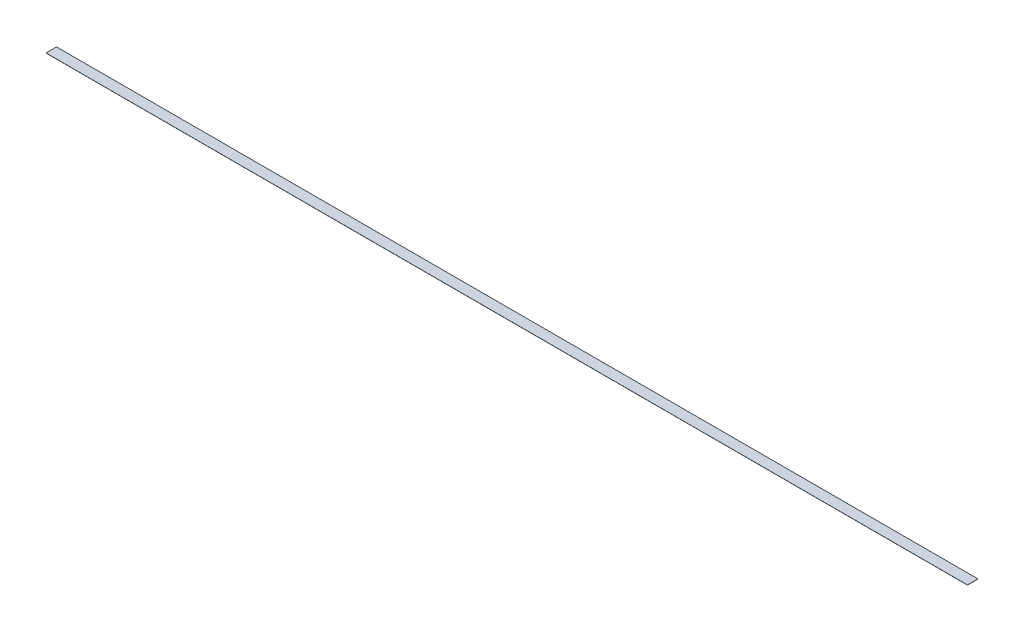
ISO-10303-21;
HEADER;
FILE_DESCRIPTION(('STEP AP214'),'2;1');
FILE_NAME('part.step','',(''),(''),'','','');
FILE_SCHEMA(('AUTOMOTIVE_DESIGN { 1 0 10303 214 1 1 1 1 }'));
ENDSEC;
DATA;
#1=APPLICATION_CONTEXT('core data for automotive mechanical design processes');
#2=APPLICATION_PROTOCOL_DEFINITION('international standard','automotive_design',2000,#1);
#3=PRODUCT_CONTEXT('',#1,'mechanical');
#4=PRODUCT('Part','Part','',(#3));
#5=PRODUCT_RELATED_PRODUCT_CATEGORY('part','',(#4));
#6=PRODUCT_DEFINITION_FORMATION('','',#4);
#7=PRODUCT_DEFINITION_CONTEXT('part definition',#1,'design');
#8=PRODUCT_DEFINITION('design','',#6,#7);
#9=PRODUCT_DEFINITION_SHAPE('','',#8);
#10=(LENGTH_UNIT() NAMED_UNIT(*) SI_UNIT(.MILLI.,.METRE.));
#11=(NAMED_UNIT(*) PLANE_ANGLE_UNIT() SI_UNIT($,.RADIAN.));
#12=(NAMED_UNIT(*) SI_UNIT($,.STERADIAN.) SOLID_ANGLE_UNIT());
#13=UNCERTAINTY_MEASURE_WITH_UNIT(LENGTH_MEASURE(1.E-05),#10,'distance_accuracy_value','');
#14=(GEOMETRIC_REPRESENTATION_CONTEXT(3) GLOBAL_UNCERTAINTY_ASSIGNED_CONTEXT((#13)) GLOBAL_UNIT_ASSIGNED_CONTEXT((#10,
#11,#12)) REPRESENTATION_CONTEXT('',''));
#15=CARTESIAN_POINT('',(0.,0.,0.));
#16=DIRECTION('',(0.,0.,1.));
#17=DIRECTION('',(1.,0.,0.));
#18=AXIS2_PLACEMENT_3D('',#15,#16,#17);
#19=CARTESIAN_POINT('',(2.22044604925031E-13,-0.249999999999905,-1.66533453693773E-13));
#20=DIRECTION('',(0.,-1.,0.));
#21=DIRECTION('',(0.,0.,-1.));
#22=AXIS2_PLACEMENT_3D('',#19,#20,#21);
#23=PLANE('',#22);
#24=DIRECTION('',(1.,0.,0.));
#25=VECTOR('',#24,1.);
#26=CARTESIAN_POINT('',(-1842.,-0.249999999999925,-2.22044604925031E-13));
#27=LINE('',#26,#25);
#28=CARTESIAN_POINT('',(-1842.,-0.250000000000036,-5.55111512312578E-13));
#29=VERTEX_POINT('',#28);
#30=CARTESIAN_POINT('',(0.,-0.25,0.));
#31=VERTEX_POINT('',#30);
#32=EDGE_CURVE('E129',#29,#31,#27,.T.);
#33=ORIENTED_EDGE('',*,*,#32,.F.);
#34=DIRECTION('',(0.,0.,1.));
#35=VECTOR('',#34,1.);
#36=CARTESIAN_POINT('',(-1842.,-0.250000000000036,-5.55111512312578E-13));
#37=LINE('',#36,#35);
#38=CARTESIAN_POINT('',(-1842.,-0.249999999999876,-21.0000000000005));
#39=VERTEX_POINT('',#38);
#40=EDGE_CURVE('E173',#39,#29,#37,.T.);
#41=ORIENTED_EDGE('',*,*,#40,.F.);
#42=DIRECTION('',(-1.,0.,0.));
#43=VECTOR('',#42,1.);
#44=CARTESIAN_POINT('',(-1842.,-0.249999999999876,-21.0000000000002));
#45=LINE('',#44,#43);
#46=CARTESIAN_POINT('',(0.,-0.25,-21.));
#47=VERTEX_POINT('',#46);
#48=EDGE_CURVE('E12',#47,#39,#45,.T.);
#49=ORIENTED_EDGE('',*,*,#48,.F.);
#50=DIRECTION('',(0.,0.,-1.));
#51=VECTOR('',#50,1.);
#52=CARTESIAN_POINT('',(0.,-0.25,0.));
#53=LINE('',#52,#51);
#54=EDGE_CURVE('E169',#31,#47,#53,.T.);
#55=ORIENTED_EDGE('',*,*,#54,.F.);
#56=EDGE_LOOP('',(#33,#41,#49,#55));
#57=FACE_BOUND('',#56,.T.);
#58=ADVANCED_FACE('F109',(#57),#23,.T.);
#59=CARTESIAN_POINT('',(-1842.,-0.249999999999925,-2.22044604925031E-13));
#60=DIRECTION('',(0.,0.,1.));
#61=DIRECTION('',(1.,0.,0.));
#62=AXIS2_PLACEMENT_3D('',#59,#60,#61);
#63=PLANE('',#62);
#64=DIRECTION('',(1.,0.,0.));
#65=VECTOR('',#64,1.);
#66=CARTESIAN_POINT('',(-1842.,0.,-2.22044604925031E-13));
#67=LINE('',#66,#65);
#68=CARTESIAN_POINT('',(-1842.,0.,-4.9960036108132E-13));
#69=VERTEX_POINT('',#68);
#70=CARTESIAN_POINT('',(0.,0.,0.));
#71=VERTEX_POINT('',#70);
#72=EDGE_CURVE('E147',#69,#71,#67,.T.);
#73=ORIENTED_EDGE('',*,*,#72,.F.);
#74=DIRECTION('',(0.,1.,0.));
#75=VECTOR('',#74,1.);
#76=CARTESIAN_POINT('',(-1842.,-0.250000000000036,-5.55111512312578E-13));
#77=LINE('',#76,#75);
#78=EDGE_CURVE('E180',#29,#69,#77,.T.);
#79=ORIENTED_EDGE('',*,*,#78,.F.);
#80=ORIENTED_EDGE('',*,*,#32,.T.);
#81=DIRECTION('',(0.,1.,0.));
#82=VECTOR('',#81,1.);
#83=CARTESIAN_POINT('',(0.,-0.25,0.));
#84=LINE('',#83,#82);
#85=EDGE_CURVE('E171',#31,#71,#84,.T.);
#86=ORIENTED_EDGE('',*,*,#85,.T.);
#87=EDGE_LOOP('',(#73,#79,#80,#86));
#88=FACE_BOUND('',#87,.T.);
#89=ADVANCED_FACE('F196',(#88),#63,.T.);
#90=CARTESIAN_POINT('',(-1842.,-0.249999999999876,-21.0000000000002));
#91=DIRECTION('',(0.,0.,-1.));
#92=DIRECTION('',(-1.,0.,0.));
#93=AXIS2_PLACEMENT_3D('',#90,#91,#92);
#94=PLANE('',#93);
#95=ORIENTED_EDGE('',*,*,#48,.T.);
#96=DIRECTION('',(0.,1.,0.));
#97=VECTOR('',#96,1.);
#98=CARTESIAN_POINT('',(-1842.,-0.249999999999876,-21.0000000000005));
#99=LINE('',#98,#97);
#100=CARTESIAN_POINT('',(-1842.,0.,-21.0000000000005));
#101=VERTEX_POINT('',#100);
#102=EDGE_CURVE('E159',#39,#101,#99,.T.);
#103=ORIENTED_EDGE('',*,*,#102,.T.);
#104=DIRECTION('',(-1.,0.,0.));
#105=VECTOR('',#104,1.);
#106=CARTESIAN_POINT('',(-1842.,0.,-21.0000000000002));
#107=LINE('',#106,#105);
#108=CARTESIAN_POINT('',(0.,0.,-21.));
#109=VERTEX_POINT('',#108);
#110=EDGE_CURVE('E120',#109,#101,#107,.T.);
#111=ORIENTED_EDGE('',*,*,#110,.F.);
#112=DIRECTION('',(0.,1.,0.));
#113=VECTOR('',#112,1.);
#114=CARTESIAN_POINT('',(0.,-0.25,-21.));
#115=LINE('',#114,#113);
#116=EDGE_CURVE('E157',#47,#109,#115,.T.);
#117=ORIENTED_EDGE('',*,*,#116,.F.);
#118=EDGE_LOOP('',(#95,#103,#111,#117));
#119=FACE_BOUND('',#118,.T.);
#120=ADVANCED_FACE('F156',(#119),#94,.T.);
#121=CARTESIAN_POINT('',(0.,0.,0.));
#122=DIRECTION('',(0.,-1.,0.));
#123=DIRECTION('',(0.,0.,-1.));
#124=AXIS2_PLACEMENT_3D('',#121,#122,#123);
#125=PLANE('',#124);
#126=ORIENTED_EDGE('',*,*,#110,.T.);
#127=DIRECTION('',(0.,0.,1.));
#128=VECTOR('',#127,1.);
#129=CARTESIAN_POINT('',(-1842.,0.,-4.9960036108132E-13));
#130=LINE('',#129,#128);
#131=EDGE_CURVE('E177',#101,#69,#130,.T.);
#132=ORIENTED_EDGE('',*,*,#131,.T.);
#133=ORIENTED_EDGE('',*,*,#72,.T.);
#134=DIRECTION('',(0.,0.,-1.));
#135=VECTOR('',#134,1.);
#136=CARTESIAN_POINT('',(0.,0.,0.));
#137=LINE('',#136,#135);
#138=EDGE_CURVE('E168',#71,#109,#137,.T.);
#139=ORIENTED_EDGE('',*,*,#138,.T.);
#140=EDGE_LOOP('',(#126,#132,#133,#139));
#141=FACE_BOUND('',#140,.T.);
#142=ADVANCED_FACE('F111',(#141),#125,.F.);
#143=CARTESIAN_POINT('',(-1842.,-0.250000000000036,-5.55111512312578E-13));
#144=DIRECTION('',(-1.,0.,0.));
#145=DIRECTION('',(0.,0.,1.));
#146=AXIS2_PLACEMENT_3D('',#143,#144,#145);
#147=PLANE('',#146);
#148=ORIENTED_EDGE('',*,*,#131,.F.);
#149=ORIENTED_EDGE('',*,*,#102,.F.);
#150=ORIENTED_EDGE('',*,*,#40,.T.);
#151=ORIENTED_EDGE('',*,*,#78,.T.);
#152=EDGE_LOOP('',(#148,#149,#150,#151));
#153=FACE_BOUND('',#152,.T.);
#154=ADVANCED_FACE('F194',(#153),#147,.T.);
#155=CARTESIAN_POINT('',(0.,-0.25,0.));
#156=DIRECTION('',(1.,0.,0.));
#157=DIRECTION('',(0.,0.,-1.));
#158=AXIS2_PLACEMENT_3D('',#155,#156,#157);
#159=PLANE('',#158);
#160=ORIENTED_EDGE('',*,*,#138,.F.);
#161=ORIENTED_EDGE('',*,*,#85,.F.);
#162=ORIENTED_EDGE('',*,*,#54,.T.);
#163=ORIENTED_EDGE('',*,*,#116,.T.);
#164=EDGE_LOOP('',(#160,#161,#162,#163));
#165=FACE_BOUND('',#164,.T.);
#166=ADVANCED_FACE('F167',(#165),#159,.T.);
#167=CLOSED_SHELL('',(#58,#89,#120,#142,#154,#166));
#168=MANIFOLD_SOLID_BREP('B2',#167);
#169=ADVANCED_BREP_SHAPE_REPRESENTATION('',(#18,#168),#14);
#170=SHAPE_DEFINITION_REPRESENTATION(#9,#169);
ENDSEC;
END-ISO-10303-21;
